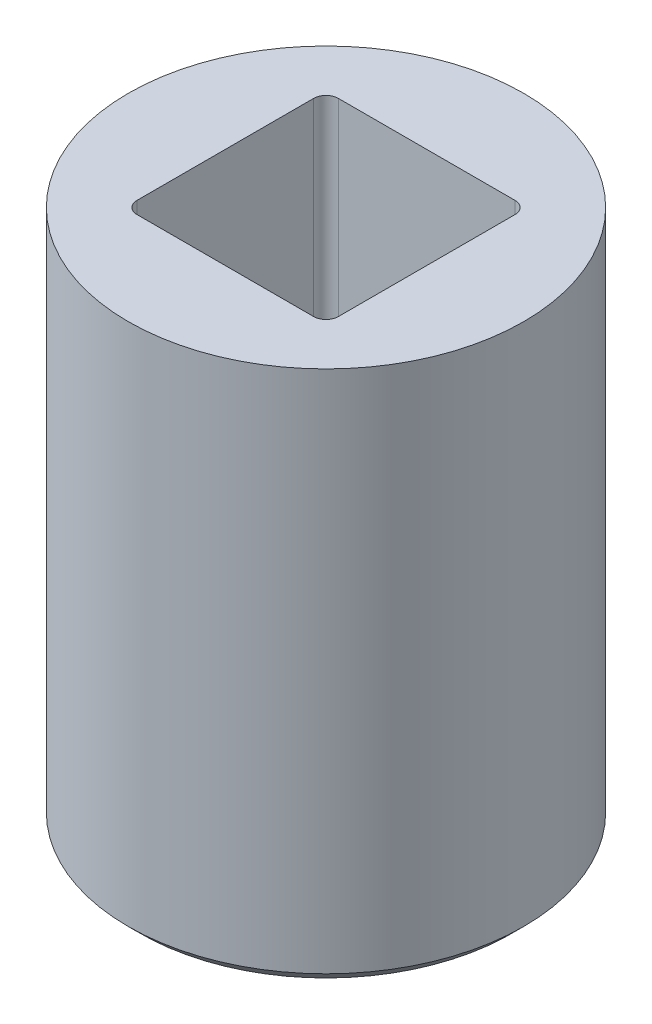
ISO-10303-21;
HEADER;
FILE_DESCRIPTION(('STEP AP214'),'2;1');
FILE_NAME('part.step','',(''),(''),'','','');
FILE_SCHEMA(('AUTOMOTIVE_DESIGN { 1 0 10303 214 1 1 1 1 }'));
ENDSEC;
DATA;
#1=APPLICATION_CONTEXT('core data for automotive mechanical design processes');
#2=APPLICATION_PROTOCOL_DEFINITION('international standard','automotive_design',2000,#1);
#3=PRODUCT_CONTEXT('',#1,'mechanical');
#4=PRODUCT('Part','Part','',(#3));
#5=PRODUCT_RELATED_PRODUCT_CATEGORY('part','',(#4));
#6=PRODUCT_DEFINITION_FORMATION('','',#4);
#7=PRODUCT_DEFINITION_CONTEXT('part definition',#1,'design');
#8=PRODUCT_DEFINITION('design','',#6,#7);
#9=PRODUCT_DEFINITION_SHAPE('','',#8);
#10=(LENGTH_UNIT() NAMED_UNIT(*) SI_UNIT(.MILLI.,.METRE.));
#11=(NAMED_UNIT(*) PLANE_ANGLE_UNIT() SI_UNIT($,.RADIAN.));
#12=(NAMED_UNIT(*) SI_UNIT($,.STERADIAN.) SOLID_ANGLE_UNIT());
#13=UNCERTAINTY_MEASURE_WITH_UNIT(LENGTH_MEASURE(1.E-05),#10,'distance_accuracy_value','');
#14=(GEOMETRIC_REPRESENTATION_CONTEXT(3) GLOBAL_UNCERTAINTY_ASSIGNED_CONTEXT((#13)) GLOBAL_UNIT_ASSIGNED_CONTEXT((#10,
#11,#12)) REPRESENTATION_CONTEXT('',''));
#15=CARTESIAN_POINT('',(0.,0.,0.));
#16=DIRECTION('',(0.,0.,1.));
#17=DIRECTION('',(1.,0.,0.));
#18=AXIS2_PLACEMENT_3D('',#15,#16,#17);
#19=CARTESIAN_POINT('',(0.,20.5994000000001,0.));
#20=DIRECTION('',(0.,1.,0.));
#21=DIRECTION('',(0.,0.,1.));
#22=AXIS2_PLACEMENT_3D('',#19,#20,#21);
#23=PLANE('',#22);
#24=CARTESIAN_POINT('',(5.67055000000013,20.5994000000001,-5.67055));
#25=DIRECTION('',(0.,-1.,0.));
#26=DIRECTION('',(1.,0.,0.));
#27=AXIS2_PLACEMENT_3D('',#24,#25,#26);
#28=CIRCLE('',#27,0.79375);
#29=CARTESIAN_POINT('',(6.46430000000006,20.5994000000001,-5.67055));
#30=VERTEX_POINT('',#29);
#31=CARTESIAN_POINT('',(5.67055000000011,20.5994000000001,-6.4643));
#32=VERTEX_POINT('',#31);
#33=EDGE_CURVE('E90',#30,#32,#28,.F.);
#34=ORIENTED_EDGE('',*,*,#33,.T.);
#35=DIRECTION('',(1.,0.,0.));
#36=VECTOR('',#35,1.);
#37=CARTESIAN_POINT('',(0.,20.5994000000001,-6.4643));
#38=LINE('',#37,#36);
#39=CARTESIAN_POINT('',(4.63450987411993,20.5994000000001,-6.4643));
#40=VERTEX_POINT('',#39);
#41=EDGE_CURVE('E206',#32,#40,#38,.F.);
#42=ORIENTED_EDGE('',*,*,#41,.T.);
#43=DIRECTION('',(-0.866025403784444,0.,-0.499999999999991));
#44=VECTOR('',#43,1.);
#45=CARTESIAN_POINT('',(0.,20.5994000000001,-9.14003552338505));
#46=LINE('',#45,#44);
#47=CARTESIAN_POINT('',(6.46430000000008,20.5994000000001,-5.40787017826258));
#48=VERTEX_POINT('',#47);
#49=EDGE_CURVE('E277',#40,#48,#46,.F.);
#50=ORIENTED_EDGE('',*,*,#49,.T.);
#51=DIRECTION('',(0.,0.,1.));
#52=VECTOR('',#51,1.);
#53=CARTESIAN_POINT('',(6.4643000000001,20.5994000000001,0.));
#54=LINE('',#53,#52);
#55=EDGE_CURVE('E211',#48,#30,#54,.F.);
#56=ORIENTED_EDGE('',*,*,#55,.T.);
#57=EDGE_LOOP('',(#34,#42,#50,#56));
#58=FACE_BOUND('',#57,.T.);
#59=ADVANCED_FACE('F17',(#58),#23,.T.);
#60=CARTESIAN_POINT('',(0.,20.5994000000001,0.));
#61=DIRECTION('',(0.,1.,0.));
#62=DIRECTION('',(0.,0.,1.));
#63=AXIS2_PLACEMENT_3D('',#60,#61,#62);
#64=PLANE('',#63);
#65=CARTESIAN_POINT('',(-5.67055,20.5994000000001,-5.67055000000013));
#66=DIRECTION('',(0.,-1.,0.));
#67=DIRECTION('',(1.,0.,0.));
#68=AXIS2_PLACEMENT_3D('',#65,#66,#67);
#69=CIRCLE('',#68,0.79375);
#70=CARTESIAN_POINT('',(-5.67054999999999,20.5994000000001,-6.46430000000006));
#71=VERTEX_POINT('',#70);
#72=CARTESIAN_POINT('',(-6.4643,20.5994000000001,-5.67055000000013));
#73=VERTEX_POINT('',#72);
#74=EDGE_CURVE('E280',#71,#73,#69,.F.);
#75=ORIENTED_EDGE('',*,*,#74,.T.);
#76=DIRECTION('',(0.,0.,1.));
#77=VECTOR('',#76,1.);
#78=CARTESIAN_POINT('',(-6.4643,20.5994000000001,0.));
#79=LINE('',#78,#77);
#80=CARTESIAN_POINT('',(-6.4643,20.5994000000001,-5.40787017826264));
#81=VERTEX_POINT('',#80);
#82=EDGE_CURVE('E196',#73,#81,#79,.T.);
#83=ORIENTED_EDGE('',*,*,#82,.T.);
#84=DIRECTION('',(-0.866025403784444,0.,0.49999999999999));
#85=VECTOR('',#84,1.);
#86=CARTESIAN_POINT('',(-7.91550295474371,20.5994000000001,-4.5700177616926));
#87=LINE('',#86,#85);
#88=CARTESIAN_POINT('',(-4.63450987411973,20.5994000000001,-6.46430000000012));
#89=VERTEX_POINT('',#88);
#90=EDGE_CURVE('E258',#81,#89,#87,.F.);
#91=ORIENTED_EDGE('',*,*,#90,.T.);
#92=DIRECTION('',(1.,0.,0.));
#93=VECTOR('',#92,1.);
#94=CARTESIAN_POINT('',(0.,20.5994000000001,-6.46430000000013));
#95=LINE('',#94,#93);
#96=EDGE_CURVE('E201',#89,#71,#95,.F.);
#97=ORIENTED_EDGE('',*,*,#96,.T.);
#98=EDGE_LOOP('',(#75,#83,#91,#97));
#99=FACE_BOUND('',#98,.T.);
#100=ADVANCED_FACE('F382',(#99),#64,.T.);
#101=CARTESIAN_POINT('',(0.,20.5994000000001,0.));
#102=DIRECTION('',(0.,1.,0.));
#103=DIRECTION('',(0.,0.,1.));
#104=AXIS2_PLACEMENT_3D('',#101,#102,#103);
#105=PLANE('',#104);
#106=CARTESIAN_POINT('',(-5.67055000000015,20.5994000000001,5.6705499999999));
#107=DIRECTION('',(0.,-1.,0.));
#108=DIRECTION('',(1.,0.,0.));
#109=AXIS2_PLACEMENT_3D('',#106,#107,#108);
#110=CIRCLE('',#109,0.79375);
#111=CARTESIAN_POINT('',(-6.46430000000008,20.5994000000001,5.67054999999989));
#112=VERTEX_POINT('',#111);
#113=CARTESIAN_POINT('',(-5.67055000000015,20.5994000000001,6.4642999999999));
#114=VERTEX_POINT('',#113);
#115=EDGE_CURVE('E295',#112,#114,#110,.F.);
#116=ORIENTED_EDGE('',*,*,#115,.T.);
#117=DIRECTION('',(1.,0.,0.));
#118=VECTOR('',#117,1.);
#119=CARTESIAN_POINT('',(0.,20.5994000000001,6.4642999999999));
#120=LINE('',#119,#118);
#121=CARTESIAN_POINT('',(-4.6345098741201,20.5994000000001,6.4642999999999));
#122=VERTEX_POINT('',#121);
#123=EDGE_CURVE('E187',#114,#122,#120,.T.);
#124=ORIENTED_EDGE('',*,*,#123,.T.);
#125=DIRECTION('',(0.866025403784444,0.,0.49999999999999));
#126=VECTOR('',#125,1.);
#127=CARTESIAN_POINT('',(0.,20.5994000000001,9.14003552338506));
#128=LINE('',#127,#126);
#129=CARTESIAN_POINT('',(-6.46430000000015,20.5994000000001,5.40787017826258));
#130=VERTEX_POINT('',#129);
#131=EDGE_CURVE('E172',#122,#130,#128,.F.);
#132=ORIENTED_EDGE('',*,*,#131,.T.);
#133=DIRECTION('',(0.,0.,1.));
#134=VECTOR('',#133,1.);
#135=CARTESIAN_POINT('',(-6.46430000000015,20.5994000000001,0.));
#136=LINE('',#135,#134);
#137=EDGE_CURVE('E192',#130,#112,#136,.T.);
#138=ORIENTED_EDGE('',*,*,#137,.T.);
#139=EDGE_LOOP('',(#116,#124,#132,#138));
#140=FACE_BOUND('',#139,.T.);
#141=ADVANCED_FACE('F364',(#140),#105,.T.);
#142=CARTESIAN_POINT('',(0.,20.5994000000001,0.));
#143=DIRECTION('',(0.,1.,0.));
#144=DIRECTION('',(0.,0.,1.));
#145=AXIS2_PLACEMENT_3D('',#142,#143,#144);
#146=PLANE('',#145);
#147=CARTESIAN_POINT('',(5.67055000000003,20.5994000000001,5.67055));
#148=DIRECTION('',(0.,-1.,0.));
#149=DIRECTION('',(1.,0.,0.));
#150=AXIS2_PLACEMENT_3D('',#147,#148,#149);
#151=CIRCLE('',#150,0.79375);
#152=CARTESIAN_POINT('',(5.67055000000003,20.5994000000001,6.46429999999995));
#153=VERTEX_POINT('',#152);
#154=CARTESIAN_POINT('',(6.46430000000003,20.5994000000001,5.67055));
#155=VERTEX_POINT('',#154);
#156=EDGE_CURVE('E300',#153,#155,#151,.F.);
#157=ORIENTED_EDGE('',*,*,#156,.T.);
#158=DIRECTION('',(0.,0.,1.));
#159=VECTOR('',#158,1.);
#160=CARTESIAN_POINT('',(6.46430000000003,20.5994000000001,0.));
#161=LINE('',#160,#159);
#162=CARTESIAN_POINT('',(6.46430000000003,20.5994000000001,5.40787017826263));
#163=VERTEX_POINT('',#162);
#164=EDGE_CURVE('E91',#155,#163,#161,.F.);
#165=ORIENTED_EDGE('',*,*,#164,.T.);
#166=DIRECTION('',(0.866025403784444,0.,-0.49999999999999));
#167=VECTOR('',#166,1.);
#168=CARTESIAN_POINT('',(7.91550295474371,20.5994000000001,4.5700177616926));
#169=LINE('',#168,#167);
#170=CARTESIAN_POINT('',(4.63450987411993,20.5994000000001,6.4643));
#171=VERTEX_POINT('',#170);
#172=EDGE_CURVE('E225',#163,#171,#169,.F.);
#173=ORIENTED_EDGE('',*,*,#172,.T.);
#174=DIRECTION('',(1.,0.,0.));
#175=VECTOR('',#174,1.);
#176=CARTESIAN_POINT('',(0.,20.5994000000001,6.4643));
#177=LINE('',#176,#175);
#178=EDGE_CURVE('E183',#171,#153,#177,.T.);
#179=ORIENTED_EDGE('',*,*,#178,.T.);
#180=EDGE_LOOP('',(#157,#165,#173,#179));
#181=FACE_BOUND('',#180,.T.);
#182=ADVANCED_FACE('F341',(#181),#146,.T.);
#183=CARTESIAN_POINT('',(0.,20.5994000000001,0.));
#184=DIRECTION('',(0.,1.,0.));
#185=DIRECTION('',(0.,0.,1.));
#186=AXIS2_PLACEMENT_3D('',#183,#184,#185);
#187=PLANE('',#186);
#188=DIRECTION('',(-0.866025403784444,0.,0.49999999999999));
#189=VECTOR('',#188,1.);
#190=CARTESIAN_POINT('',(-7.91550295474371,20.5994000000001,-4.5700177616926));
#191=LINE('',#190,#189);
#192=CARTESIAN_POINT('',(0.,20.5994000000001,-9.14003552338505));
#193=VERTEX_POINT('',#192);
#194=EDGE_CURVE('E180',#89,#193,#191,.F.);
#195=ORIENTED_EDGE('',*,*,#194,.T.);
#196=DIRECTION('',(-0.866025403784444,0.,-0.499999999999991));
#197=VECTOR('',#196,1.);
#198=CARTESIAN_POINT('',(0.,20.5994000000001,-9.14003552338505));
#199=LINE('',#198,#197);
#200=EDGE_CURVE('E261',#193,#40,#199,.F.);
#201=ORIENTED_EDGE('',*,*,#200,.T.);
#202=DIRECTION('',(-1.,0.,0.));
#203=VECTOR('',#202,1.);
#204=CARTESIAN_POINT('',(5.6705500000001,20.5994000000001,-6.4643));
#205=LINE('',#204,#203);
#206=EDGE_CURVE('E148',#40,#89,#205,.T.);
#207=ORIENTED_EDGE('',*,*,#206,.T.);
#208=EDGE_LOOP('',(#195,#201,#207));
#209=FACE_BOUND('',#208,.T.);
#210=ADVANCED_FACE('F595',(#209),#187,.F.);
#211=CARTESIAN_POINT('',(0.,20.5994000000001,0.));
#212=DIRECTION('',(0.,1.,0.));
#213=DIRECTION('',(0.,0.,1.));
#214=AXIS2_PLACEMENT_3D('',#211,#212,#213);
#215=PLANE('',#214);
#216=DIRECTION('',(-0.866025403784444,0.,-0.499999999999991));
#217=VECTOR('',#216,1.);
#218=CARTESIAN_POINT('',(0.,20.5994000000001,-9.14003552338505));
#219=LINE('',#218,#217);
#220=CARTESIAN_POINT('',(7.91550295474371,20.5994000000001,-4.5700177616926));
#221=VERTEX_POINT('',#220);
#222=EDGE_CURVE('E274',#48,#221,#219,.F.);
#223=ORIENTED_EDGE('',*,*,#222,.T.);
#224=DIRECTION('',(0.,0.,-1.));
#225=VECTOR('',#224,1.);
#226=CARTESIAN_POINT('',(7.91550295474371,20.5994000000001,-4.5700177616926));
#227=LINE('',#226,#225);
#228=CARTESIAN_POINT('',(7.91550295474371,20.5994000000001,4.5700177616926));
#229=VERTEX_POINT('',#228);
#230=EDGE_CURVE('E150',#221,#229,#227,.F.);
#231=ORIENTED_EDGE('',*,*,#230,.T.);
#232=DIRECTION('',(0.866025403784444,0.,-0.49999999999999));
#233=VECTOR('',#232,1.);
#234=CARTESIAN_POINT('',(7.91550295474371,20.5994000000001,4.5700177616926));
#235=LINE('',#234,#233);
#236=EDGE_CURVE('E159',#229,#163,#235,.F.);
#237=ORIENTED_EDGE('',*,*,#236,.T.);
#238=DIRECTION('',(0.,0.,-1.));
#239=VECTOR('',#238,1.);
#240=CARTESIAN_POINT('',(6.46430000000003,20.5994000000001,5.67055));
#241=LINE('',#240,#239);
#242=EDGE_CURVE('E100',#163,#48,#241,.T.);
#243=ORIENTED_EDGE('',*,*,#242,.T.);
#244=EDGE_LOOP('',(#223,#231,#237,#243));
#245=FACE_BOUND('',#244,.T.);
#246=ADVANCED_FACE('F327',(#245),#215,.F.);
#247=CARTESIAN_POINT('',(5.67055000000013,34.43605,-5.67055));
#248=DIRECTION('',(0.,-1.,0.));
#249=DIRECTION('',(1.,0.,0.));
#250=AXIS2_PLACEMENT_3D('',#247,#248,#249);
#251=CYLINDRICAL_SURFACE('',#250,0.79375);
#252=DIRECTION('',(0.,1.,0.));
#253=VECTOR('',#252,1.);
#254=CARTESIAN_POINT('',(6.46430000000003,34.43605,-5.67055));
#255=LINE('',#254,#253);
#256=CARTESIAN_POINT('',(6.46430000000006,34.43605,-5.67055));
#257=VERTEX_POINT('',#256);
#258=EDGE_CURVE('E94',#30,#257,#255,.T.);
#259=ORIENTED_EDGE('',*,*,#258,.T.);
#260=CARTESIAN_POINT('',(5.67055000000013,34.43605,-5.67055));
#261=DIRECTION('',(0.,-1.,0.));
#262=DIRECTION('',(1.,0.,0.));
#263=AXIS2_PLACEMENT_3D('',#260,#261,#262);
#264=CIRCLE('',#263,0.79375);
#265=CARTESIAN_POINT('',(5.67055000000011,34.43605,-6.46430000000006));
#266=VERTEX_POINT('',#265);
#267=EDGE_CURVE('E20',#266,#257,#264,.T.);
#268=ORIENTED_EDGE('',*,*,#267,.F.);
#269=DIRECTION('',(0.,1.,0.));
#270=VECTOR('',#269,1.);
#271=CARTESIAN_POINT('',(5.6705500000001,34.43605,-6.4643));
#272=LINE('',#271,#270);
#273=EDGE_CURVE('E147',#266,#32,#272,.F.);
#274=ORIENTED_EDGE('',*,*,#273,.T.);
#275=ORIENTED_EDGE('',*,*,#33,.F.);
#276=EDGE_LOOP('',(#259,#268,#274,#275));
#277=FACE_BOUND('',#276,.T.);
#278=ADVANCED_FACE('F95',(#277),#251,.F.);
#279=CARTESIAN_POINT('',(0.,20.5994000000001,0.));
#280=DIRECTION('',(0.,1.,0.));
#281=DIRECTION('',(0.,0.,1.));
#282=AXIS2_PLACEMENT_3D('',#279,#280,#281);
#283=PLANE('',#282);
#284=DIRECTION('',(0.866025403784444,0.,-0.49999999999999));
#285=VECTOR('',#284,1.);
#286=CARTESIAN_POINT('',(7.91550295474371,20.5994000000001,4.5700177616926));
#287=LINE('',#286,#285);
#288=CARTESIAN_POINT('',(0.,20.5994000000001,9.14003552338505));
#289=VERTEX_POINT('',#288);
#290=EDGE_CURVE('E163',#171,#289,#287,.F.);
#291=ORIENTED_EDGE('',*,*,#290,.T.);
#292=DIRECTION('',(0.866025403784444,0.,0.49999999999999));
#293=VECTOR('',#292,1.);
#294=CARTESIAN_POINT('',(0.,20.5994000000001,9.14003552338506));
#295=LINE('',#294,#293);
#296=EDGE_CURVE('E167',#289,#122,#295,.F.);
#297=ORIENTED_EDGE('',*,*,#296,.T.);
#298=DIRECTION('',(1.,0.,0.));
#299=VECTOR('',#298,1.);
#300=CARTESIAN_POINT('',(-5.67055000000015,20.5994000000001,6.4642999999999));
#301=LINE('',#300,#299);
#302=EDGE_CURVE('E141',#122,#171,#301,.T.);
#303=ORIENTED_EDGE('',*,*,#302,.T.);
#304=EDGE_LOOP('',(#291,#297,#303));
#305=FACE_BOUND('',#304,.T.);
#306=ADVANCED_FACE('F348',(#305),#283,.F.);
#307=CARTESIAN_POINT('',(5.67055000000003,34.43605,5.67055));
#308=DIRECTION('',(0.,-1.,0.));
#309=DIRECTION('',(1.,0.,0.));
#310=AXIS2_PLACEMENT_3D('',#307,#308,#309);
#311=CYLINDRICAL_SURFACE('',#310,0.79375);
#312=DIRECTION('',(0.,1.,0.));
#313=VECTOR('',#312,1.);
#314=CARTESIAN_POINT('',(5.67055000000003,34.43605,6.4642999999999));
#315=LINE('',#314,#313);
#316=CARTESIAN_POINT('',(5.67055000000003,34.43605,6.46429999999995));
#317=VERTEX_POINT('',#316);
#318=EDGE_CURVE('E137',#153,#317,#315,.T.);
#319=ORIENTED_EDGE('',*,*,#318,.T.);
#320=CARTESIAN_POINT('',(5.67055000000003,34.43605,5.67055));
#321=DIRECTION('',(0.,-1.,0.));
#322=DIRECTION('',(1.,0.,0.));
#323=AXIS2_PLACEMENT_3D('',#320,#321,#322);
#324=CIRCLE('',#323,0.79375);
#325=CARTESIAN_POINT('',(6.46430000000006,34.43605,5.67055));
#326=VERTEX_POINT('',#325);
#327=EDGE_CURVE('E303',#326,#317,#324,.T.);
#328=ORIENTED_EDGE('',*,*,#327,.F.);
#329=DIRECTION('',(0.,1.,0.));
#330=VECTOR('',#329,1.);
#331=CARTESIAN_POINT('',(6.46430000000003,34.43605,5.67055));
#332=LINE('',#331,#330);
#333=EDGE_CURVE('E99',#326,#155,#332,.F.);
#334=ORIENTED_EDGE('',*,*,#333,.T.);
#335=ORIENTED_EDGE('',*,*,#156,.F.);
#336=EDGE_LOOP('',(#319,#328,#334,#335));
#337=FACE_BOUND('',#336,.T.);
#338=ADVANCED_FACE('F565',(#337),#311,.F.);
#339=CARTESIAN_POINT('',(0.,20.5994000000001,0.));
#340=DIRECTION('',(0.,1.,0.));
#341=DIRECTION('',(0.,0.,1.));
#342=AXIS2_PLACEMENT_3D('',#339,#340,#341);
#343=PLANE('',#342);
#344=DIRECTION('',(0.866025403784444,0.,0.49999999999999));
#345=VECTOR('',#344,1.);
#346=CARTESIAN_POINT('',(0.,20.5994000000001,9.14003552338506));
#347=LINE('',#346,#345);
#348=CARTESIAN_POINT('',(-7.91550295474371,20.5994000000001,4.5700177616926));
#349=VERTEX_POINT('',#348);
#350=EDGE_CURVE('E168',#130,#349,#347,.F.);
#351=ORIENTED_EDGE('',*,*,#350,.T.);
#352=DIRECTION('',(0.,0.,1.));
#353=VECTOR('',#352,1.);
#354=CARTESIAN_POINT('',(-7.91550295474371,20.5994000000001,4.5700177616926));
#355=LINE('',#354,#353);
#356=CARTESIAN_POINT('',(-7.91550295474371,20.5994000000001,-4.5700177616926));
#357=VERTEX_POINT('',#356);
#358=EDGE_CURVE('E169',#349,#357,#355,.F.);
#359=ORIENTED_EDGE('',*,*,#358,.T.);
#360=DIRECTION('',(-0.866025403784444,0.,0.49999999999999));
#361=VECTOR('',#360,1.);
#362=CARTESIAN_POINT('',(-7.91550295474371,20.5994000000001,-4.5700177616926));
#363=LINE('',#362,#361);
#364=EDGE_CURVE('E176',#357,#81,#363,.F.);
#365=ORIENTED_EDGE('',*,*,#364,.T.);
#366=DIRECTION('',(0.,0.,1.));
#367=VECTOR('',#366,1.);
#368=CARTESIAN_POINT('',(-6.4643,20.5994000000001,-5.67055000000013));
#369=LINE('',#368,#367);
#370=EDGE_CURVE('E135',#81,#130,#369,.T.);
#371=ORIENTED_EDGE('',*,*,#370,.T.);
#372=EDGE_LOOP('',(#351,#359,#365,#371));
#373=FACE_BOUND('',#372,.T.);
#374=ADVANCED_FACE('F370',(#373),#343,.F.);
#375=CARTESIAN_POINT('',(-5.67055000000015,34.43605,5.6705499999999));
#376=DIRECTION('',(0.,-1.,0.));
#377=DIRECTION('',(1.,0.,0.));
#378=AXIS2_PLACEMENT_3D('',#375,#376,#377);
#379=CYLINDRICAL_SURFACE('',#378,0.79375);
#380=DIRECTION('',(0.,1.,0.));
#381=VECTOR('',#380,1.);
#382=CARTESIAN_POINT('',(-6.4643,34.43605,5.67054999999987));
#383=LINE('',#382,#381);
#384=CARTESIAN_POINT('',(-6.46430000000008,34.43605,5.67054999999989));
#385=VERTEX_POINT('',#384);
#386=EDGE_CURVE('E132',#112,#385,#383,.T.);
#387=ORIENTED_EDGE('',*,*,#386,.T.);
#388=CARTESIAN_POINT('',(-5.67055000000015,34.43605,5.6705499999999));
#389=DIRECTION('',(0.,-1.,0.));
#390=DIRECTION('',(1.,0.,0.));
#391=AXIS2_PLACEMENT_3D('',#388,#389,#390);
#392=CIRCLE('',#391,0.79375);
#393=CARTESIAN_POINT('',(-5.67055000000015,34.43605,6.46429999999995));
#394=VERTEX_POINT('',#393);
#395=EDGE_CURVE('E298',#394,#385,#392,.T.);
#396=ORIENTED_EDGE('',*,*,#395,.F.);
#397=DIRECTION('',(0.,1.,0.));
#398=VECTOR('',#397,1.);
#399=CARTESIAN_POINT('',(-5.67055000000015,34.43605,6.4642999999999));
#400=LINE('',#399,#398);
#401=EDGE_CURVE('E140',#394,#114,#400,.F.);
#402=ORIENTED_EDGE('',*,*,#401,.T.);
#403=ORIENTED_EDGE('',*,*,#115,.F.);
#404=EDGE_LOOP('',(#387,#396,#402,#403));
#405=FACE_BOUND('',#404,.T.);
#406=ADVANCED_FACE('F549',(#405),#379,.F.);
#407=CARTESIAN_POINT('',(-5.67055,34.43605,-5.67055000000013));
#408=DIRECTION('',(0.,-1.,0.));
#409=DIRECTION('',(1.,0.,0.));
#410=AXIS2_PLACEMENT_3D('',#407,#408,#409);
#411=CYLINDRICAL_SURFACE('',#410,0.79375);
#412=DIRECTION('',(0.,1.,0.));
#413=VECTOR('',#412,1.);
#414=CARTESIAN_POINT('',(-5.67054999999998,34.43605,-6.4643));
#415=LINE('',#414,#413);
#416=CARTESIAN_POINT('',(-5.67054999999999,34.43605,-6.46430000000006));
#417=VERTEX_POINT('',#416);
#418=EDGE_CURVE('E145',#71,#417,#415,.T.);
#419=ORIENTED_EDGE('',*,*,#418,.T.);
#420=CARTESIAN_POINT('',(-5.67055,34.43605,-5.67055000000013));
#421=DIRECTION('',(0.,-1.,0.));
#422=DIRECTION('',(1.,0.,0.));
#423=AXIS2_PLACEMENT_3D('',#420,#421,#422);
#424=CIRCLE('',#423,0.79375);
#425=CARTESIAN_POINT('',(-6.46430000000008,34.43605,-5.67055000000013));
#426=VERTEX_POINT('',#425);
#427=EDGE_CURVE('E35',#426,#417,#424,.T.);
#428=ORIENTED_EDGE('',*,*,#427,.F.);
#429=DIRECTION('',(0.,1.,0.));
#430=VECTOR('',#429,1.);
#431=CARTESIAN_POINT('',(-6.4643,34.43605,-5.67055000000013));
#432=LINE('',#431,#430);
#433=EDGE_CURVE('E131',#426,#73,#432,.F.);
#434=ORIENTED_EDGE('',*,*,#433,.T.);
#435=ORIENTED_EDGE('',*,*,#74,.F.);
#436=EDGE_LOOP('',(#419,#428,#434,#435));
#437=FACE_BOUND('',#436,.T.);
#438=ADVANCED_FACE('F541',(#437),#411,.F.);
#439=CARTESIAN_POINT('',(0.,0.,-9.14003552338505));
#440=DIRECTION('',(0.499999999999991,0.,-0.866025403784444));
#441=DIRECTION('',(-0.866025403784444,0.,-0.499999999999991));
#442=AXIS2_PLACEMENT_3D('',#439,#440,#441);
#443=PLANE('',#442);
#444=DIRECTION('',(0.,1.,0.));
#445=VECTOR('',#444,1.);
#446=CARTESIAN_POINT('',(0.,0.,-9.14003552338504));
#447=LINE('',#446,#445);
#448=CARTESIAN_POINT('',(0.,0.,-9.14003552338505));
#449=VERTEX_POINT('',#448);
#450=EDGE_CURVE('E177',#193,#449,#447,.F.);
#451=ORIENTED_EDGE('',*,*,#450,.T.);
#452=DIRECTION('',(-0.866025403784444,0.,-0.499999999999991));
#453=VECTOR('',#452,1.);
#454=CARTESIAN_POINT('',(7.91550295474371,0.,-4.5700177616926));
#455=LINE('',#454,#453);
#456=CARTESIAN_POINT('',(7.91550295474371,0.,-4.5700177616926));
#457=VERTEX_POINT('',#456);
#458=EDGE_CURVE('E128',#457,#449,#455,.T.);
#459=ORIENTED_EDGE('',*,*,#458,.F.);
#460=DIRECTION('',(0.,1.,0.));
#461=VECTOR('',#460,1.);
#462=CARTESIAN_POINT('',(7.91550295474371,0.,-4.5700177616926));
#463=LINE('',#462,#461);
#464=EDGE_CURVE('E153',#457,#221,#463,.T.);
#465=ORIENTED_EDGE('',*,*,#464,.T.);
#466=ORIENTED_EDGE('',*,*,#222,.F.);
#467=ORIENTED_EDGE('',*,*,#49,.F.);
#468=ORIENTED_EDGE('',*,*,#200,.F.);
#469=EDGE_LOOP('',(#451,#459,#465,#466,#467,#468));
#470=FACE_BOUND('',#469,.T.);
#471=ADVANCED_FACE('F320',(#470),#443,.F.);
#472=CARTESIAN_POINT('',(-7.91550295474371,0.,-4.5700177616926));
#473=DIRECTION('',(-0.49999999999999,0.,-0.866025403784444));
#474=DIRECTION('',(-0.866025403784444,0.,0.49999999999999));
#475=AXIS2_PLACEMENT_3D('',#472,#473,#474);
#476=PLANE('',#475);
#477=DIRECTION('',(0.,1.,0.));
#478=VECTOR('',#477,1.);
#479=CARTESIAN_POINT('',(-7.91550295474371,0.,-4.5700177616926));
#480=LINE('',#479,#478);
#481=CARTESIAN_POINT('',(-7.91550295474371,0.,-4.5700177616926));
#482=VERTEX_POINT('',#481);
#483=EDGE_CURVE('E173',#357,#482,#480,.F.);
#484=ORIENTED_EDGE('',*,*,#483,.T.);
#485=DIRECTION('',(-0.866025403784444,0.,0.499999999999991));
#486=VECTOR('',#485,1.);
#487=CARTESIAN_POINT('',(0.,0.,-9.14003552338505));
#488=LINE('',#487,#486);
#489=EDGE_CURVE('E125',#449,#482,#488,.T.);
#490=ORIENTED_EDGE('',*,*,#489,.F.);
#491=ORIENTED_EDGE('',*,*,#450,.F.);
#492=ORIENTED_EDGE('',*,*,#194,.F.);
#493=ORIENTED_EDGE('',*,*,#90,.F.);
#494=ORIENTED_EDGE('',*,*,#364,.F.);
#495=EDGE_LOOP('',(#484,#490,#491,#492,#493,#494));
#496=FACE_BOUND('',#495,.T.);
#497=ADVANCED_FACE('F380',(#496),#476,.F.);
#498=CARTESIAN_POINT('',(-7.91550295474371,0.,4.5700177616926));
#499=DIRECTION('',(-1.,0.,0.));
#500=DIRECTION('',(0.,0.,1.));
#501=AXIS2_PLACEMENT_3D('',#498,#499,#500);
#502=PLANE('',#501);
#503=DIRECTION('',(0.,1.,0.));
#504=VECTOR('',#503,1.);
#505=CARTESIAN_POINT('',(-7.91550295474371,0.,4.57001776169261));
#506=LINE('',#505,#504);
#507=CARTESIAN_POINT('',(-7.91550295474371,0.,4.5700177616926));
#508=VERTEX_POINT('',#507);
#509=EDGE_CURVE('E164',#349,#508,#506,.F.);
#510=ORIENTED_EDGE('',*,*,#509,.T.);
#511=DIRECTION('',(0.,0.,-1.));
#512=VECTOR('',#511,1.);
#513=CARTESIAN_POINT('',(-7.91550295474371,0.,0.));
#514=LINE('',#513,#512);
#515=EDGE_CURVE('E122',#482,#508,#514,.F.);
#516=ORIENTED_EDGE('',*,*,#515,.F.);
#517=ORIENTED_EDGE('',*,*,#483,.F.);
#518=ORIENTED_EDGE('',*,*,#358,.F.);
#519=EDGE_LOOP('',(#510,#516,#517,#518));
#520=FACE_BOUND('',#519,.T.);
#521=ADVANCED_FACE('F416',(#520),#502,.F.);
#522=CARTESIAN_POINT('',(0.,0.,9.14003552338505));
#523=DIRECTION('',(-0.49999999999999,0.,0.866025403784444));
#524=DIRECTION('',(0.866025403784444,0.,0.49999999999999));
#525=AXIS2_PLACEMENT_3D('',#522,#523,#524);
#526=PLANE('',#525);
#527=DIRECTION('',(0.,1.,0.));
#528=VECTOR('',#527,1.);
#529=CARTESIAN_POINT('',(0.,0.,9.14003552338504));
#530=LINE('',#529,#528);
#531=CARTESIAN_POINT('',(0.,0.,9.14003552338505));
#532=VERTEX_POINT('',#531);
#533=EDGE_CURVE('E160',#289,#532,#530,.F.);
#534=ORIENTED_EDGE('',*,*,#533,.T.);
#535=DIRECTION('',(0.866025403784444,0.,0.499999999999991));
#536=VECTOR('',#535,1.);
#537=CARTESIAN_POINT('',(-7.91550295474371,0.,4.5700177616926));
#538=LINE('',#537,#536);
#539=EDGE_CURVE('E119',#508,#532,#538,.T.);
#540=ORIENTED_EDGE('',*,*,#539,.F.);
#541=ORIENTED_EDGE('',*,*,#509,.F.);
#542=ORIENTED_EDGE('',*,*,#350,.F.);
#543=ORIENTED_EDGE('',*,*,#131,.F.);
#544=ORIENTED_EDGE('',*,*,#296,.F.);
#545=EDGE_LOOP('',(#534,#540,#541,#542,#543,#544));
#546=FACE_BOUND('',#545,.T.);
#547=ADVANCED_FACE('F361',(#546),#526,.F.);
#548=CARTESIAN_POINT('',(7.91550295474371,0.,4.5700177616926));
#549=DIRECTION('',(0.49999999999999,0.,0.866025403784444));
#550=DIRECTION('',(0.866025403784444,0.,-0.49999999999999));
#551=AXIS2_PLACEMENT_3D('',#548,#549,#550);
#552=PLANE('',#551);
#553=DIRECTION('',(0.,1.,0.));
#554=VECTOR('',#553,1.);
#555=CARTESIAN_POINT('',(7.91550295474371,0.,4.5700177616926));
#556=LINE('',#555,#554);
#557=CARTESIAN_POINT('',(7.91550295474371,0.,4.5700177616926));
#558=VERTEX_POINT('',#557);
#559=EDGE_CURVE('E156',#229,#558,#556,.F.);
#560=ORIENTED_EDGE('',*,*,#559,.T.);
#561=DIRECTION('',(0.866025403784444,0.,-0.499999999999991));
#562=VECTOR('',#561,1.);
#563=CARTESIAN_POINT('',(0.,0.,9.14003552338505));
#564=LINE('',#563,#562);
#565=EDGE_CURVE('E116',#532,#558,#564,.T.);
#566=ORIENTED_EDGE('',*,*,#565,.F.);
#567=ORIENTED_EDGE('',*,*,#533,.F.);
#568=ORIENTED_EDGE('',*,*,#290,.F.);
#569=ORIENTED_EDGE('',*,*,#172,.F.);
#570=ORIENTED_EDGE('',*,*,#236,.F.);
#571=EDGE_LOOP('',(#560,#566,#567,#568,#569,#570));
#572=FACE_BOUND('',#571,.T.);
#573=ADVANCED_FACE('F337',(#572),#552,.F.);
#574=CARTESIAN_POINT('',(7.91550295474371,0.,-4.5700177616926));
#575=DIRECTION('',(1.,0.,0.));
#576=DIRECTION('',(0.,0.,-1.));
#577=AXIS2_PLACEMENT_3D('',#574,#575,#576);
#578=PLANE('',#577);
#579=ORIENTED_EDGE('',*,*,#464,.F.);
#580=DIRECTION('',(0.,0.,-1.));
#581=VECTOR('',#580,1.);
#582=CARTESIAN_POINT('',(7.91550295474371,0.,0.));
#583=LINE('',#582,#581);
#584=EDGE_CURVE('E110',#558,#457,#583,.T.);
#585=ORIENTED_EDGE('',*,*,#584,.F.);
#586=ORIENTED_EDGE('',*,*,#559,.F.);
#587=ORIENTED_EDGE('',*,*,#230,.F.);
#588=EDGE_LOOP('',(#579,#585,#586,#587));
#589=FACE_BOUND('',#588,.T.);
#590=ADVANCED_FACE('F409',(#589),#578,.F.);
#591=CARTESIAN_POINT('',(5.6705500000001,34.43605,-6.4643));
#592=DIRECTION('',(0.,0.,-1.));
#593=DIRECTION('',(-1.,0.,0.));
#594=AXIS2_PLACEMENT_3D('',#591,#592,#593);
#595=PLANE('',#594);
#596=ORIENTED_EDGE('',*,*,#273,.F.);
#597=DIRECTION('',(1.,0.,0.));
#598=VECTOR('',#597,1.);
#599=CARTESIAN_POINT('',(-6.34999999999998,34.43605,-6.46430000000013));
#600=LINE('',#599,#598);
#601=EDGE_CURVE('E89',#417,#266,#600,.T.);
#602=ORIENTED_EDGE('',*,*,#601,.F.);
#603=ORIENTED_EDGE('',*,*,#418,.F.);
#604=ORIENTED_EDGE('',*,*,#96,.F.);
#605=ORIENTED_EDGE('',*,*,#206,.F.);
#606=ORIENTED_EDGE('',*,*,#41,.F.);
#607=EDGE_LOOP('',(#596,#602,#603,#604,#605,#606));
#608=FACE_BOUND('',#607,.T.);
#609=ADVANCED_FACE('F307',(#608),#595,.F.);
#610=CARTESIAN_POINT('',(6.46430000000003,34.43605,5.67055));
#611=DIRECTION('',(1.,0.,0.));
#612=DIRECTION('',(0.,0.,-1.));
#613=AXIS2_PLACEMENT_3D('',#610,#611,#612);
#614=PLANE('',#613);
#615=ORIENTED_EDGE('',*,*,#333,.F.);
#616=DIRECTION('',(0.,0.,1.));
#617=VECTOR('',#616,1.);
#618=CARTESIAN_POINT('',(6.4643000000001,34.43605,0.));
#619=LINE('',#618,#617);
#620=EDGE_CURVE('E87',#257,#326,#619,.T.);
#621=ORIENTED_EDGE('',*,*,#620,.F.);
#622=ORIENTED_EDGE('',*,*,#258,.F.);
#623=ORIENTED_EDGE('',*,*,#55,.F.);
#624=ORIENTED_EDGE('',*,*,#242,.F.);
#625=ORIENTED_EDGE('',*,*,#164,.F.);
#626=EDGE_LOOP('',(#615,#621,#622,#623,#624,#625));
#627=FACE_BOUND('',#626,.T.);
#628=ADVANCED_FACE('F103',(#627),#614,.F.);
#629=CARTESIAN_POINT('',(-5.67055000000015,34.43605,6.4642999999999));
#630=DIRECTION('',(0.,0.,1.));
#631=DIRECTION('',(1.,0.,0.));
#632=AXIS2_PLACEMENT_3D('',#629,#630,#631);
#633=PLANE('',#632);
#634=ORIENTED_EDGE('',*,*,#401,.F.);
#635=DIRECTION('',(1.,0.,0.));
#636=VECTOR('',#635,1.);
#637=CARTESIAN_POINT('',(-6.34999999999998,34.43605,6.4643));
#638=LINE('',#637,#636);
#639=EDGE_CURVE('E105',#317,#394,#638,.F.);
#640=ORIENTED_EDGE('',*,*,#639,.F.);
#641=ORIENTED_EDGE('',*,*,#318,.F.);
#642=ORIENTED_EDGE('',*,*,#178,.F.);
#643=ORIENTED_EDGE('',*,*,#302,.F.);
#644=ORIENTED_EDGE('',*,*,#123,.F.);
#645=EDGE_LOOP('',(#634,#640,#641,#642,#643,#644));
#646=FACE_BOUND('',#645,.T.);
#647=ADVANCED_FACE('F354',(#646),#633,.F.);
#648=CARTESIAN_POINT('',(-6.4643,34.43605,-5.67055000000013));
#649=DIRECTION('',(-1.,0.,0.));
#650=DIRECTION('',(0.,0.,1.));
#651=AXIS2_PLACEMENT_3D('',#648,#649,#650);
#652=PLANE('',#651);
#653=ORIENTED_EDGE('',*,*,#433,.F.);
#654=DIRECTION('',(0.,0.,1.));
#655=VECTOR('',#654,1.);
#656=CARTESIAN_POINT('',(-6.46430000000015,34.43605,0.));
#657=LINE('',#656,#655);
#658=EDGE_CURVE('E108',#385,#426,#657,.F.);
#659=ORIENTED_EDGE('',*,*,#658,.F.);
#660=ORIENTED_EDGE('',*,*,#386,.F.);
#661=ORIENTED_EDGE('',*,*,#137,.F.);
#662=ORIENTED_EDGE('',*,*,#370,.F.);
#663=ORIENTED_EDGE('',*,*,#82,.F.);
#664=EDGE_LOOP('',(#653,#659,#660,#661,#662,#663));
#665=FACE_BOUND('',#664,.T.);
#666=ADVANCED_FACE('F376',(#665),#652,.F.);
#667=CARTESIAN_POINT('',(-5.95312500000003,0.,0.));
#668=DIRECTION('',(0.,-1.,0.));
#669=DIRECTION('',(0.,0.,-1.));
#670=AXIS2_PLACEMENT_3D('',#667,#668,#669);
#671=PLANE('',#670);
#672=ORIENTED_EDGE('',*,*,#565,.T.);
#673=ORIENTED_EDGE('',*,*,#584,.T.);
#674=ORIENTED_EDGE('',*,*,#458,.T.);
#675=ORIENTED_EDGE('',*,*,#489,.T.);
#676=ORIENTED_EDGE('',*,*,#515,.T.);
#677=ORIENTED_EDGE('',*,*,#539,.T.);
#678=EDGE_LOOP('',(#672,#673,#674,#675,#676,#677));
#679=FACE_BOUND('',#678,.T.);
#680=CARTESIAN_POINT('',(0.,-3.56126152872838E-10,0.));
#681=DIRECTION('',(0.,1.,0.));
#682=DIRECTION('',(-1.,0.,0.));
#683=AXIS2_PLACEMENT_3D('',#680,#681,#682);
#684=CIRCLE('',#683,11.9062500003562);
#685=CARTESIAN_POINT('',(-11.9062500003562,-3.56127474244235E-10,0.));
#686=VERTEX_POINT('',#685);
#687=EDGE_CURVE('E289',#686,#686,#684,.T.);
#688=ORIENTED_EDGE('',*,*,#687,.F.);
#689=EDGE_LOOP('',(#688));
#690=FACE_BOUND('',#689,.T.);
#691=ADVANCED_FACE('F411',(#679,#690),#671,.T.);
#692=CARTESIAN_POINT('',(-6.34999999999998,34.43605,0.));
#693=DIRECTION('',(0.,1.,0.));
#694=DIRECTION('',(0.,0.,1.));
#695=AXIS2_PLACEMENT_3D('',#692,#693,#694);
#696=PLANE('',#695);
#697=ORIENTED_EDGE('',*,*,#658,.T.);
#698=ORIENTED_EDGE('',*,*,#427,.T.);
#699=ORIENTED_EDGE('',*,*,#601,.T.);
#700=ORIENTED_EDGE('',*,*,#267,.T.);
#701=ORIENTED_EDGE('',*,*,#620,.T.);
#702=ORIENTED_EDGE('',*,*,#327,.T.);
#703=ORIENTED_EDGE('',*,*,#639,.T.);
#704=ORIENTED_EDGE('',*,*,#395,.T.);
#705=EDGE_LOOP('',(#697,#698,#699,#700,#701,#702,#703,#704));
#706=FACE_BOUND('',#705,.T.);
#707=CARTESIAN_POINT('',(0.,34.4360500000001,0.));
#708=DIRECTION('',(0.,1.,0.));
#709=DIRECTION('',(-1.,0.,0.));
#710=AXIS2_PLACEMENT_3D('',#707,#708,#709);
#711=CIRCLE('',#710,12.7);
#712=CARTESIAN_POINT('',(-12.7,34.4360500000001,0.));
#713=VERTEX_POINT('',#712);
#714=EDGE_CURVE('E26',#713,#713,#711,.F.);
#715=ORIENTED_EDGE('',*,*,#714,.F.);
#716=EDGE_LOOP('',(#715));
#717=FACE_BOUND('',#716,.T.);
#718=ADVANCED_FACE('F84',(#706,#717),#696,.T.);
#719=CARTESIAN_POINT('',(0.,0.793750000356228,0.));
#720=DIRECTION('',(0.,1.,0.));
#721=DIRECTION('',(-1.,0.,0.));
#722=AXIS2_PLACEMENT_3D('',#719,#720,#721);
#723=CONICAL_SURFACE('',#722,12.6999999996439,0.7853981625);
#724=ORIENTED_EDGE('',*,*,#687,.T.);
#725=EDGE_LOOP('',(#724));
#726=FACE_BOUND('',#725,.T.);
#727=CARTESIAN_POINT('',(0.,0.793750000000051,0.));
#728=DIRECTION('',(0.,1.,0.));
#729=DIRECTION('',(-1.,0.,0.));
#730=AXIS2_PLACEMENT_3D('',#727,#728,#729);
#731=CIRCLE('',#730,12.7);
#732=CARTESIAN_POINT('',(-12.7,0.79375000000005,0.));
#733=VERTEX_POINT('',#732);
#734=EDGE_CURVE('E11',#733,#733,#731,.T.);
#735=ORIENTED_EDGE('',*,*,#734,.F.);
#736=EDGE_LOOP('',(#735));
#737=FACE_BOUND('',#736,.T.);
#738=ADVANCED_FACE('F430',(#726,#737),#723,.T.);
#739=CARTESIAN_POINT('',(0.,17.6149000000001,0.));
#740=DIRECTION('',(0.,1.,0.));
#741=DIRECTION('',(-1.,0.,0.));
#742=AXIS2_PLACEMENT_3D('',#739,#740,#741);
#743=CYLINDRICAL_SURFACE('',#742,12.7);
#744=ORIENTED_EDGE('',*,*,#734,.T.);
#745=EDGE_LOOP('',(#744));
#746=FACE_BOUND('',#745,.T.);
#747=ORIENTED_EDGE('',*,*,#714,.T.);
#748=EDGE_LOOP('',(#747));
#749=FACE_BOUND('',#748,.T.);
#750=ADVANCED_FACE('F428',(#746,#749),#743,.T.);
#751=CLOSED_SHELL('',(#59,#100,#141,#182,#210,#246,#278,#306,#338,#374,#406,#438,#471,#497,#521,
#547,#573,#590,#609,#628,#647,#666,#691,#718,#738,#750));
#752=MANIFOLD_SOLID_BREP('B1',#751);
#753=ADVANCED_BREP_SHAPE_REPRESENTATION('',(#18,#752),#14);
#754=SHAPE_DEFINITION_REPRESENTATION(#9,#753);
ENDSEC;
END-ISO-10303-21;
